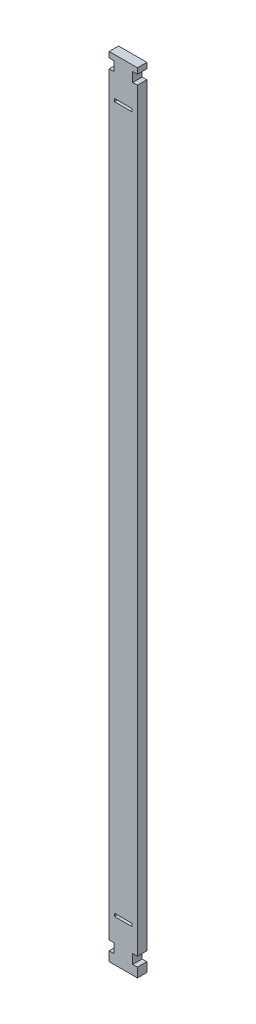
ISO-10303-21;
HEADER;
FILE_DESCRIPTION(('STEP AP214'),'2;1');
FILE_NAME('part.step','',(''),(''),'','','');
FILE_SCHEMA(('AUTOMOTIVE_DESIGN { 1 0 10303 214 1 1 1 1 }'));
ENDSEC;
DATA;
#1=APPLICATION_CONTEXT('core data for automotive mechanical design processes');
#2=APPLICATION_PROTOCOL_DEFINITION('international standard','automotive_design',2000,#1);
#3=PRODUCT_CONTEXT('',#1,'mechanical');
#4=PRODUCT('Part','Part','',(#3));
#5=PRODUCT_RELATED_PRODUCT_CATEGORY('part','',(#4));
#6=PRODUCT_DEFINITION_FORMATION('','',#4);
#7=PRODUCT_DEFINITION_CONTEXT('part definition',#1,'design');
#8=PRODUCT_DEFINITION('design','',#6,#7);
#9=PRODUCT_DEFINITION_SHAPE('','',#8);
#10=(LENGTH_UNIT() NAMED_UNIT(*) SI_UNIT(.MILLI.,.METRE.));
#11=(NAMED_UNIT(*) PLANE_ANGLE_UNIT() SI_UNIT($,.RADIAN.));
#12=(NAMED_UNIT(*) SI_UNIT($,.STERADIAN.) SOLID_ANGLE_UNIT());
#13=UNCERTAINTY_MEASURE_WITH_UNIT(LENGTH_MEASURE(1.E-05),#10,'distance_accuracy_value','');
#14=(GEOMETRIC_REPRESENTATION_CONTEXT(3) GLOBAL_UNCERTAINTY_ASSIGNED_CONTEXT((#13)) GLOBAL_UNIT_ASSIGNED_CONTEXT((#10,
#11,#12)) REPRESENTATION_CONTEXT('',''));
#15=CARTESIAN_POINT('',(0.,0.,0.));
#16=DIRECTION('',(0.,0.,1.));
#17=DIRECTION('',(1.,0.,0.));
#18=AXIS2_PLACEMENT_3D('',#15,#16,#17);
#19=CARTESIAN_POINT('',(7.49999999999998,-225.,5.));
#20=DIRECTION('',(-1.,0.,0.));
#21=DIRECTION('',(0.,0.,1.));
#22=AXIS2_PLACEMENT_3D('',#19,#20,#21);
#23=PLANE('',#22);
#24=DIRECTION('',(0.,1.,0.));
#25=VECTOR('',#24,1.);
#26=CARTESIAN_POINT('',(7.49999999999998,-225.,0.));
#27=LINE('',#26,#25);
#28=CARTESIAN_POINT('',(7.49999999999998,-225.,0.));
#29=VERTEX_POINT('',#28);
#30=CARTESIAN_POINT('',(7.49999999999998,-220.,0.));
#31=VERTEX_POINT('',#30);
#32=EDGE_CURVE('E414',#29,#31,#27,.T.);
#33=ORIENTED_EDGE('',*,*,#32,.T.);
#34=DIRECTION('',(0.,0.,1.));
#35=VECTOR('',#34,1.);
#36=CARTESIAN_POINT('',(7.49999999999998,-220.,-0.00100000000000013));
#37=LINE('',#36,#35);
#38=CARTESIAN_POINT('',(7.49999999999998,-220.,5.));
#39=VERTEX_POINT('',#38);
#40=EDGE_CURVE('E341',#31,#39,#37,.T.);
#41=ORIENTED_EDGE('',*,*,#40,.T.);
#42=DIRECTION('',(0.,1.,0.));
#43=VECTOR('',#42,1.);
#44=CARTESIAN_POINT('',(7.49999999999998,-225.,5.));
#45=LINE('',#44,#43);
#46=CARTESIAN_POINT('',(7.49999999999998,-225.,5.));
#47=VERTEX_POINT('',#46);
#48=EDGE_CURVE('E403',#47,#39,#45,.T.);
#49=ORIENTED_EDGE('',*,*,#48,.F.);
#50=DIRECTION('',(0.,0.,-1.));
#51=VECTOR('',#50,1.);
#52=CARTESIAN_POINT('',(7.49999999999998,-225.,5.));
#53=LINE('',#52,#51);
#54=EDGE_CURVE('E42',#47,#29,#53,.T.);
#55=ORIENTED_EDGE('',*,*,#54,.T.);
#56=EDGE_LOOP('',(#33,#41,#49,#55));
#57=FACE_BOUND('',#56,.T.);
#58=ADVANCED_FACE('F34',(#57),#23,.F.);
#59=CARTESIAN_POINT('',(7.49999999999998,-215.,5.));
#60=VERTEX_POINT('',#59);
#61=CARTESIAN_POINT('',(7.49999999999998,185.,5.));
#62=VERTEX_POINT('',#61);
#63=EDGE_CURVE('E407',#60,#62,#45,.T.);
#64=ORIENTED_EDGE('',*,*,#63,.F.);
#65=DIRECTION('',(0.,0.,1.));
#66=VECTOR('',#65,1.);
#67=CARTESIAN_POINT('',(7.49999999999998,-215.,-0.00100000000000013));
#68=LINE('',#67,#66);
#69=CARTESIAN_POINT('',(7.49999999999998,-215.,0.));
#70=VERTEX_POINT('',#69);
#71=EDGE_CURVE('E340',#70,#60,#68,.T.);
#72=ORIENTED_EDGE('',*,*,#71,.F.);
#73=CARTESIAN_POINT('',(7.49999999999998,185.,0.));
#74=VERTEX_POINT('',#73);
#75=EDGE_CURVE('E418',#70,#74,#27,.T.);
#76=ORIENTED_EDGE('',*,*,#75,.T.);
#77=DIRECTION('',(0.,0.,1.));
#78=VECTOR('',#77,1.);
#79=CARTESIAN_POINT('',(7.49999999999998,185.,-0.00100000000000013));
#80=LINE('',#79,#78);
#81=EDGE_CURVE('E305',#74,#62,#80,.T.);
#82=ORIENTED_EDGE('',*,*,#81,.T.);
#83=EDGE_LOOP('',(#64,#72,#76,#82));
#84=FACE_BOUND('',#83,.T.);
#85=ADVANCED_FACE('F500',(#84),#23,.F.);
#86=CARTESIAN_POINT('',(-7.50000000000001,-225.,5.));
#87=DIRECTION('',(1.,0.,0.));
#88=DIRECTION('',(0.,0.,-1.));
#89=AXIS2_PLACEMENT_3D('',#86,#87,#88);
#90=PLANE('',#89);
#91=DIRECTION('',(0.,-1.,0.));
#92=VECTOR('',#91,1.);
#93=CARTESIAN_POINT('',(-7.50000000000001,-225.,0.));
#94=LINE('',#93,#92);
#95=CARTESIAN_POINT('',(-7.50000000000001,193.,0.));
#96=VERTEX_POINT('',#95);
#97=CARTESIAN_POINT('',(-7.50000000000001,190.,0.));
#98=VERTEX_POINT('',#97);
#99=EDGE_CURVE('E421',#96,#98,#94,.T.);
#100=ORIENTED_EDGE('',*,*,#99,.T.);
#101=DIRECTION('',(0.,0.,1.));
#102=VECTOR('',#101,1.);
#103=CARTESIAN_POINT('',(-7.50000000000001,190.,-0.00100000000000013));
#104=LINE('',#103,#102);
#105=CARTESIAN_POINT('',(-7.50000000000001,190.,5.));
#106=VERTEX_POINT('',#105);
#107=EDGE_CURVE('E367',#98,#106,#104,.T.);
#108=ORIENTED_EDGE('',*,*,#107,.T.);
#109=DIRECTION('',(0.,-1.,0.));
#110=VECTOR('',#109,1.);
#111=CARTESIAN_POINT('',(-7.50000000000001,-225.,5.));
#112=LINE('',#111,#110);
#113=CARTESIAN_POINT('',(-7.5,193.,5.));
#114=VERTEX_POINT('',#113);
#115=EDGE_CURVE('E411',#114,#106,#112,.T.);
#116=ORIENTED_EDGE('',*,*,#115,.F.);
#117=DIRECTION('',(0.,0.,1.));
#118=VECTOR('',#117,1.);
#119=CARTESIAN_POINT('',(-7.5,193.,-0.00100000000000013));
#120=LINE('',#119,#118);
#121=EDGE_CURVE('E318',#96,#114,#120,.T.);
#122=ORIENTED_EDGE('',*,*,#121,.F.);
#123=EDGE_LOOP('',(#100,#108,#116,#122));
#124=FACE_BOUND('',#123,.T.);
#125=ADVANCED_FACE('F472',(#124),#90,.F.);
#126=CARTESIAN_POINT('',(-7.50000000000001,185.,5.));
#127=VERTEX_POINT('',#126);
#128=CARTESIAN_POINT('',(-7.50000000000001,-215.,5.));
#129=VERTEX_POINT('',#128);
#130=EDGE_CURVE('E410',#127,#129,#112,.T.);
#131=ORIENTED_EDGE('',*,*,#130,.F.);
#132=DIRECTION('',(0.,0.,1.));
#133=VECTOR('',#132,1.);
#134=CARTESIAN_POINT('',(-7.50000000000001,185.,-0.00100000000000013));
#135=LINE('',#134,#133);
#136=CARTESIAN_POINT('',(-7.50000000000001,185.,0.));
#137=VERTEX_POINT('',#136);
#138=EDGE_CURVE('E366',#137,#127,#135,.T.);
#139=ORIENTED_EDGE('',*,*,#138,.F.);
#140=CARTESIAN_POINT('',(-7.50000000000001,-215.,0.));
#141=VERTEX_POINT('',#140);
#142=EDGE_CURVE('E420',#137,#141,#94,.T.);
#143=ORIENTED_EDGE('',*,*,#142,.T.);
#144=DIRECTION('',(0.,0.,1.));
#145=VECTOR('',#144,1.);
#146=CARTESIAN_POINT('',(-7.50000000000001,-215.,-0.00100000000000013));
#147=LINE('',#146,#145);
#148=EDGE_CURVE('E391',#141,#129,#147,.T.);
#149=ORIENTED_EDGE('',*,*,#148,.T.);
#150=EDGE_LOOP('',(#131,#139,#143,#149));
#151=FACE_BOUND('',#150,.T.);
#152=ADVANCED_FACE('F466',(#151),#90,.F.);
#153=CARTESIAN_POINT('',(7.49999999999998,190.,5.));
#154=VERTEX_POINT('',#153);
#155=CARTESIAN_POINT('',(7.49999999999998,193.,5.));
#156=VERTEX_POINT('',#155);
#157=EDGE_CURVE('E408',#154,#156,#45,.T.);
#158=ORIENTED_EDGE('',*,*,#157,.F.);
#159=DIRECTION('',(0.,0.,1.));
#160=VECTOR('',#159,1.);
#161=CARTESIAN_POINT('',(7.49999999999998,190.,-0.00100000000000013));
#162=LINE('',#161,#160);
#163=CARTESIAN_POINT('',(7.49999999999998,190.,0.));
#164=VERTEX_POINT('',#163);
#165=EDGE_CURVE('E304',#164,#154,#162,.T.);
#166=ORIENTED_EDGE('',*,*,#165,.F.);
#167=CARTESIAN_POINT('',(7.49999999999998,193.,0.));
#168=VERTEX_POINT('',#167);
#169=EDGE_CURVE('E402',#164,#168,#27,.T.);
#170=ORIENTED_EDGE('',*,*,#169,.T.);
#171=DIRECTION('',(0.,0.,1.));
#172=VECTOR('',#171,1.);
#173=CARTESIAN_POINT('',(7.49999999999998,193.,-0.00100000000000013));
#174=LINE('',#173,#172);
#175=EDGE_CURVE('E319',#168,#156,#174,.T.);
#176=ORIENTED_EDGE('',*,*,#175,.T.);
#177=EDGE_LOOP('',(#158,#166,#170,#176));
#178=FACE_BOUND('',#177,.T.);
#179=ADVANCED_FACE('F36',(#178),#23,.F.);
#180=CARTESIAN_POINT('',(-7.50000000000001,-220.,5.));
#181=VERTEX_POINT('',#180);
#182=CARTESIAN_POINT('',(-7.50000000000001,-225.,5.));
#183=VERTEX_POINT('',#182);
#184=EDGE_CURVE('E406',#181,#183,#112,.T.);
#185=ORIENTED_EDGE('',*,*,#184,.F.);
#186=DIRECTION('',(0.,0.,1.));
#187=VECTOR('',#186,1.);
#188=CARTESIAN_POINT('',(-7.50000000000001,-220.,-0.00100000000000013));
#189=LINE('',#188,#187);
#190=CARTESIAN_POINT('',(-7.50000000000001,-220.,0.));
#191=VERTEX_POINT('',#190);
#192=EDGE_CURVE('E390',#191,#181,#189,.T.);
#193=ORIENTED_EDGE('',*,*,#192,.F.);
#194=CARTESIAN_POINT('',(-7.50000000000001,-225.,0.));
#195=VERTEX_POINT('',#194);
#196=EDGE_CURVE('E417',#191,#195,#94,.T.);
#197=ORIENTED_EDGE('',*,*,#196,.T.);
#198=DIRECTION('',(0.,0.,-1.));
#199=VECTOR('',#198,1.);
#200=CARTESIAN_POINT('',(-7.50000000000001,-225.,5.));
#201=LINE('',#200,#199);
#202=EDGE_CURVE('E11',#183,#195,#201,.T.);
#203=ORIENTED_EDGE('',*,*,#202,.F.);
#204=EDGE_LOOP('',(#185,#193,#197,#203));
#205=FACE_BOUND('',#204,.T.);
#206=ADVANCED_FACE('F449',(#205),#90,.F.);
#207=CARTESIAN_POINT('',(-7.50000000000001,-225.,5.));
#208=DIRECTION('',(0.,1.,0.));
#209=DIRECTION('',(0.,0.,1.));
#210=AXIS2_PLACEMENT_3D('',#207,#208,#209);
#211=PLANE('',#210);
#212=DIRECTION('',(1.,0.,0.));
#213=VECTOR('',#212,1.);
#214=CARTESIAN_POINT('',(-7.50000000000001,-225.,0.));
#215=LINE('',#214,#213);
#216=EDGE_CURVE('E422',#195,#29,#215,.T.);
#217=ORIENTED_EDGE('',*,*,#216,.T.);
#218=ORIENTED_EDGE('',*,*,#54,.F.);
#219=DIRECTION('',(1.,0.,0.));
#220=VECTOR('',#219,1.);
#221=CARTESIAN_POINT('',(-7.50000000000001,-225.,5.));
#222=LINE('',#221,#220);
#223=EDGE_CURVE('E412',#183,#47,#222,.T.);
#224=ORIENTED_EDGE('',*,*,#223,.F.);
#225=ORIENTED_EDGE('',*,*,#202,.T.);
#226=EDGE_LOOP('',(#217,#218,#224,#225));
#227=FACE_BOUND('',#226,.T.);
#228=ADVANCED_FACE('F447',(#227),#211,.F.);
#229=CARTESIAN_POINT('',(0.,0.,5.));
#230=DIRECTION('',(0.,0.,-1.));
#231=DIRECTION('',(-1.,0.,0.));
#232=AXIS2_PLACEMENT_3D('',#229,#230,#231);
#233=PLANE('',#232);
#234=DIRECTION('',(-1.,0.,0.));
#235=VECTOR('',#234,1.);
#236=CARTESIAN_POINT('',(-4.74999999999991,-201.335,5.));
#237=LINE('',#236,#235);
#238=CARTESIAN_POINT('',(4.75000000000009,-201.335,5.));
#239=VERTEX_POINT('',#238);
#240=CARTESIAN_POINT('',(-4.74999999999991,-201.335,5.));
#241=VERTEX_POINT('',#240);
#242=EDGE_CURVE('E243',#239,#241,#237,.T.);
#243=ORIENTED_EDGE('',*,*,#242,.F.);
#244=DIRECTION('',(0.,1.,0.));
#245=VECTOR('',#244,1.);
#246=CARTESIAN_POINT('',(4.75000000000009,-201.335,5.));
#247=LINE('',#246,#245);
#248=CARTESIAN_POINT('',(4.75000000000009,-202.835,5.));
#249=VERTEX_POINT('',#248);
#250=EDGE_CURVE('E49',#249,#239,#247,.T.);
#251=ORIENTED_EDGE('',*,*,#250,.F.);
#252=DIRECTION('',(1.,0.,0.));
#253=VECTOR('',#252,1.);
#254=CARTESIAN_POINT('',(-4.74999999999991,-202.835,5.));
#255=LINE('',#254,#253);
#256=CARTESIAN_POINT('',(-4.74999999999991,-202.835,5.));
#257=VERTEX_POINT('',#256);
#258=EDGE_CURVE('E236',#257,#249,#255,.T.);
#259=ORIENTED_EDGE('',*,*,#258,.F.);
#260=DIRECTION('',(0.,-1.,0.));
#261=VECTOR('',#260,1.);
#262=CARTESIAN_POINT('',(-4.74999999999991,-201.335,5.));
#263=LINE('',#262,#261);
#264=EDGE_CURVE('E250',#241,#257,#263,.T.);
#265=ORIENTED_EDGE('',*,*,#264,.F.);
#266=EDGE_LOOP('',(#243,#251,#259,#265));
#267=FACE_BOUND('',#266,.T.);
#268=DIRECTION('',(-1.,0.,0.));
#269=VECTOR('',#268,1.);
#270=CARTESIAN_POINT('',(-4.75,172.835,5.));
#271=LINE('',#270,#269);
#272=CARTESIAN_POINT('',(4.75,172.835,5.));
#273=VERTEX_POINT('',#272);
#274=CARTESIAN_POINT('',(-4.75,172.835,5.));
#275=VERTEX_POINT('',#274);
#276=EDGE_CURVE('E269',#273,#275,#271,.T.);
#277=ORIENTED_EDGE('',*,*,#276,.F.);
#278=DIRECTION('',(0.,1.,0.));
#279=VECTOR('',#278,1.);
#280=CARTESIAN_POINT('',(4.75,171.335,5.));
#281=LINE('',#280,#279);
#282=CARTESIAN_POINT('',(4.75,171.335,5.));
#283=VERTEX_POINT('',#282);
#284=EDGE_CURVE('E57',#283,#273,#281,.T.);
#285=ORIENTED_EDGE('',*,*,#284,.F.);
#286=DIRECTION('',(1.,0.,0.));
#287=VECTOR('',#286,1.);
#288=CARTESIAN_POINT('',(-4.75,171.335,5.));
#289=LINE('',#288,#287);
#290=CARTESIAN_POINT('',(-4.75,171.335,5.));
#291=VERTEX_POINT('',#290);
#292=EDGE_CURVE('E275',#291,#283,#289,.T.);
#293=ORIENTED_EDGE('',*,*,#292,.F.);
#294=DIRECTION('',(0.,-1.,0.));
#295=VECTOR('',#294,1.);
#296=CARTESIAN_POINT('',(-4.75,171.335,5.));
#297=LINE('',#296,#295);
#298=EDGE_CURVE('E272',#275,#291,#297,.T.);
#299=ORIENTED_EDGE('',*,*,#298,.F.);
#300=EDGE_LOOP('',(#277,#285,#293,#299));
#301=FACE_BOUND('',#300,.T.);
#302=ORIENTED_EDGE('',*,*,#48,.T.);
#303=DIRECTION('',(1.,0.,0.));
#304=VECTOR('',#303,1.);
#305=CARTESIAN_POINT('',(7.49999999999998,-220.,5.));
#306=LINE('',#305,#304);
#307=CARTESIAN_POINT('',(4.99999999999998,-220.,5.));
#308=VERTEX_POINT('',#307);
#309=EDGE_CURVE('E338',#308,#39,#306,.T.);
#310=ORIENTED_EDGE('',*,*,#309,.F.);
#311=DIRECTION('',(0.,-1.,0.));
#312=VECTOR('',#311,1.);
#313=CARTESIAN_POINT('',(4.99999999999998,-215.,5.));
#314=LINE('',#313,#312);
#315=CARTESIAN_POINT('',(4.99999999999998,-215.,5.));
#316=VERTEX_POINT('',#315);
#317=EDGE_CURVE('E335',#316,#308,#314,.T.);
#318=ORIENTED_EDGE('',*,*,#317,.F.);
#319=DIRECTION('',(-1.,0.,0.));
#320=VECTOR('',#319,1.);
#321=CARTESIAN_POINT('',(7.49999999999998,-215.,5.));
#322=LINE('',#321,#320);
#323=EDGE_CURVE('E332',#60,#316,#322,.T.);
#324=ORIENTED_EDGE('',*,*,#323,.F.);
#325=ORIENTED_EDGE('',*,*,#63,.T.);
#326=DIRECTION('',(1.,0.,0.));
#327=VECTOR('',#326,1.);
#328=CARTESIAN_POINT('',(7.49999999999998,185.,5.));
#329=LINE('',#328,#327);
#330=CARTESIAN_POINT('',(4.99999999999996,185.,5.));
#331=VERTEX_POINT('',#330);
#332=EDGE_CURVE('E302',#331,#62,#329,.T.);
#333=ORIENTED_EDGE('',*,*,#332,.F.);
#334=DIRECTION('',(0.,-1.,0.));
#335=VECTOR('',#334,1.);
#336=CARTESIAN_POINT('',(4.99999999999996,190.,5.));
#337=LINE('',#336,#335);
#338=CARTESIAN_POINT('',(4.99999999999996,190.,5.));
#339=VERTEX_POINT('',#338);
#340=EDGE_CURVE('E299',#339,#331,#337,.T.);
#341=ORIENTED_EDGE('',*,*,#340,.F.);
#342=DIRECTION('',(-1.,0.,0.));
#343=VECTOR('',#342,1.);
#344=CARTESIAN_POINT('',(7.49999999999998,190.,5.));
#345=LINE('',#344,#343);
#346=EDGE_CURVE('E296',#154,#339,#345,.T.);
#347=ORIENTED_EDGE('',*,*,#346,.F.);
#348=ORIENTED_EDGE('',*,*,#157,.T.);
#349=DIRECTION('',(1.,0.,0.));
#350=VECTOR('',#349,1.);
#351=CARTESIAN_POINT('',(-7.5,193.,5.));
#352=LINE('',#351,#350);
#353=EDGE_CURVE('E230',#114,#156,#352,.T.);
#354=ORIENTED_EDGE('',*,*,#353,.F.);
#355=ORIENTED_EDGE('',*,*,#115,.T.);
#356=DIRECTION('',(-1.,0.,0.));
#357=VECTOR('',#356,1.);
#358=CARTESIAN_POINT('',(-7.50000000000001,190.,5.));
#359=LINE('',#358,#357);
#360=CARTESIAN_POINT('',(-5.00000000000001,190.,5.));
#361=VERTEX_POINT('',#360);
#362=EDGE_CURVE('E364',#361,#106,#359,.T.);
#363=ORIENTED_EDGE('',*,*,#362,.F.);
#364=DIRECTION('',(0.,1.,0.));
#365=VECTOR('',#364,1.);
#366=CARTESIAN_POINT('',(-5.00000000000001,190.,5.));
#367=LINE('',#366,#365);
#368=CARTESIAN_POINT('',(-5.00000000000001,185.,5.));
#369=VERTEX_POINT('',#368);
#370=EDGE_CURVE('E361',#369,#361,#367,.T.);
#371=ORIENTED_EDGE('',*,*,#370,.F.);
#372=DIRECTION('',(1.,0.,0.));
#373=VECTOR('',#372,1.);
#374=CARTESIAN_POINT('',(-7.50000000000001,185.,5.));
#375=LINE('',#374,#373);
#376=EDGE_CURVE('E358',#127,#369,#375,.T.);
#377=ORIENTED_EDGE('',*,*,#376,.F.);
#378=ORIENTED_EDGE('',*,*,#130,.T.);
#379=DIRECTION('',(-1.,0.,0.));
#380=VECTOR('',#379,1.);
#381=CARTESIAN_POINT('',(-7.50000000000001,-215.,5.));
#382=LINE('',#381,#380);
#383=CARTESIAN_POINT('',(-5.00000000000001,-215.,5.));
#384=VERTEX_POINT('',#383);
#385=EDGE_CURVE('E388',#384,#129,#382,.T.);
#386=ORIENTED_EDGE('',*,*,#385,.F.);
#387=DIRECTION('',(0.,1.,0.));
#388=VECTOR('',#387,1.);
#389=CARTESIAN_POINT('',(-5.00000000000001,-215.,5.));
#390=LINE('',#389,#388);
#391=CARTESIAN_POINT('',(-5.00000000000001,-220.,5.));
#392=VERTEX_POINT('',#391);
#393=EDGE_CURVE('E385',#392,#384,#390,.T.);
#394=ORIENTED_EDGE('',*,*,#393,.F.);
#395=DIRECTION('',(1.,0.,0.));
#396=VECTOR('',#395,1.);
#397=CARTESIAN_POINT('',(-7.50000000000001,-220.,5.));
#398=LINE('',#397,#396);
#399=EDGE_CURVE('E382',#181,#392,#398,.T.);
#400=ORIENTED_EDGE('',*,*,#399,.F.);
#401=ORIENTED_EDGE('',*,*,#184,.T.);
#402=ORIENTED_EDGE('',*,*,#223,.T.);
#403=EDGE_LOOP('',(#302,#310,#318,#324,#325,#333,#341,#347,#348,#354,#355,#363,#371,#377,#378,
#386,#394,#400,#401,#402));
#404=FACE_BOUND('',#403,.T.);
#405=ADVANCED_FACE('F443',(#267,#301,#404),#233,.F.);
#406=CARTESIAN_POINT('',(0.,0.,0.));
#407=DIRECTION('',(0.,0.,-1.));
#408=DIRECTION('',(-1.,0.,0.));
#409=AXIS2_PLACEMENT_3D('',#406,#407,#408);
#410=PLANE('',#409);
#411=DIRECTION('',(0.,1.,0.));
#412=VECTOR('',#411,1.);
#413=CARTESIAN_POINT('',(4.75000000000009,-201.335,0.));
#414=LINE('',#413,#412);
#415=CARTESIAN_POINT('',(4.75000000000009,-202.835,0.));
#416=VERTEX_POINT('',#415);
#417=CARTESIAN_POINT('',(4.75000000000009,-201.335,0.));
#418=VERTEX_POINT('',#417);
#419=EDGE_CURVE('E234',#416,#418,#414,.T.);
#420=ORIENTED_EDGE('',*,*,#419,.T.);
#421=DIRECTION('',(-1.,0.,0.));
#422=VECTOR('',#421,1.);
#423=CARTESIAN_POINT('',(-4.74999999999991,-201.335,0.));
#424=LINE('',#423,#422);
#425=CARTESIAN_POINT('',(-4.74999999999991,-201.335,0.));
#426=VERTEX_POINT('',#425);
#427=EDGE_CURVE('E220',#418,#426,#424,.T.);
#428=ORIENTED_EDGE('',*,*,#427,.T.);
#429=DIRECTION('',(0.,-1.,0.));
#430=VECTOR('',#429,1.);
#431=CARTESIAN_POINT('',(-4.74999999999991,-201.335,0.));
#432=LINE('',#431,#430);
#433=CARTESIAN_POINT('',(-4.74999999999991,-202.835,0.));
#434=VERTEX_POINT('',#433);
#435=EDGE_CURVE('E245',#426,#434,#432,.T.);
#436=ORIENTED_EDGE('',*,*,#435,.T.);
#437=DIRECTION('',(1.,0.,0.));
#438=VECTOR('',#437,1.);
#439=CARTESIAN_POINT('',(-4.74999999999991,-202.835,0.));
#440=LINE('',#439,#438);
#441=EDGE_CURVE('E241',#434,#416,#440,.T.);
#442=ORIENTED_EDGE('',*,*,#441,.T.);
#443=EDGE_LOOP('',(#420,#428,#436,#442));
#444=FACE_BOUND('',#443,.T.);
#445=DIRECTION('',(0.,1.,0.));
#446=VECTOR('',#445,1.);
#447=CARTESIAN_POINT('',(4.75,171.335,0.));
#448=LINE('',#447,#446);
#449=CARTESIAN_POINT('',(4.75,171.335,0.));
#450=VERTEX_POINT('',#449);
#451=CARTESIAN_POINT('',(4.75,172.835,0.));
#452=VERTEX_POINT('',#451);
#453=EDGE_CURVE('E265',#450,#452,#448,.T.);
#454=ORIENTED_EDGE('',*,*,#453,.T.);
#455=DIRECTION('',(-1.,0.,0.));
#456=VECTOR('',#455,1.);
#457=CARTESIAN_POINT('',(-4.75,172.835,0.));
#458=LINE('',#457,#456);
#459=CARTESIAN_POINT('',(-4.75,172.835,0.));
#460=VERTEX_POINT('',#459);
#461=EDGE_CURVE('E281',#452,#460,#458,.T.);
#462=ORIENTED_EDGE('',*,*,#461,.T.);
#463=DIRECTION('',(0.,-1.,0.));
#464=VECTOR('',#463,1.);
#465=CARTESIAN_POINT('',(-4.75,171.335,0.));
#466=LINE('',#465,#464);
#467=CARTESIAN_POINT('',(-4.75,171.335,0.));
#468=VERTEX_POINT('',#467);
#469=EDGE_CURVE('E259',#460,#468,#466,.T.);
#470=ORIENTED_EDGE('',*,*,#469,.T.);
#471=DIRECTION('',(1.,0.,0.));
#472=VECTOR('',#471,1.);
#473=CARTESIAN_POINT('',(-4.75,171.335,0.));
#474=LINE('',#473,#472);
#475=EDGE_CURVE('E262',#468,#450,#474,.T.);
#476=ORIENTED_EDGE('',*,*,#475,.T.);
#477=EDGE_LOOP('',(#454,#462,#470,#476));
#478=FACE_BOUND('',#477,.T.);
#479=DIRECTION('',(1.,0.,0.));
#480=VECTOR('',#479,1.);
#481=CARTESIAN_POINT('',(7.49999999999998,-220.,0.));
#482=LINE('',#481,#480);
#483=CARTESIAN_POINT('',(4.99999999999998,-220.,0.));
#484=VERTEX_POINT('',#483);
#485=EDGE_CURVE('E328',#484,#31,#482,.T.);
#486=ORIENTED_EDGE('',*,*,#485,.T.);
#487=ORIENTED_EDGE('',*,*,#32,.F.);
#488=ORIENTED_EDGE('',*,*,#216,.F.);
#489=ORIENTED_EDGE('',*,*,#196,.F.);
#490=DIRECTION('',(1.,0.,0.));
#491=VECTOR('',#490,1.);
#492=CARTESIAN_POINT('',(-7.50000000000001,-220.,0.));
#493=LINE('',#492,#491);
#494=CARTESIAN_POINT('',(-5.00000000000001,-220.,0.));
#495=VERTEX_POINT('',#494);
#496=EDGE_CURVE('E394',#191,#495,#493,.T.);
#497=ORIENTED_EDGE('',*,*,#496,.T.);
#498=DIRECTION('',(0.,1.,0.));
#499=VECTOR('',#498,1.);
#500=CARTESIAN_POINT('',(-5.00000000000001,-215.,0.));
#501=LINE('',#500,#499);
#502=CARTESIAN_POINT('',(-5.00000000000001,-215.,0.));
#503=VERTEX_POINT('',#502);
#504=EDGE_CURVE('E352',#495,#503,#501,.T.);
#505=ORIENTED_EDGE('',*,*,#504,.T.);
#506=DIRECTION('',(-1.,0.,0.));
#507=VECTOR('',#506,1.);
#508=CARTESIAN_POINT('',(-7.50000000000001,-215.,0.));
#509=LINE('',#508,#507);
#510=EDGE_CURVE('E379',#503,#141,#509,.T.);
#511=ORIENTED_EDGE('',*,*,#510,.T.);
#512=ORIENTED_EDGE('',*,*,#142,.F.);
#513=DIRECTION('',(1.,0.,0.));
#514=VECTOR('',#513,1.);
#515=CARTESIAN_POINT('',(-7.50000000000001,185.,0.));
#516=LINE('',#515,#514);
#517=CARTESIAN_POINT('',(-5.00000000000001,185.,0.));
#518=VERTEX_POINT('',#517);
#519=EDGE_CURVE('E329',#137,#518,#516,.T.);
#520=ORIENTED_EDGE('',*,*,#519,.T.);
#521=DIRECTION('',(0.,1.,0.));
#522=VECTOR('',#521,1.);
#523=CARTESIAN_POINT('',(-5.00000000000001,190.,0.));
#524=LINE('',#523,#522);
#525=CARTESIAN_POINT('',(-5.00000000000001,190.,0.));
#526=VERTEX_POINT('',#525);
#527=EDGE_CURVE('E316',#518,#526,#524,.T.);
#528=ORIENTED_EDGE('',*,*,#527,.T.);
#529=DIRECTION('',(-1.,0.,0.));
#530=VECTOR('',#529,1.);
#531=CARTESIAN_POINT('',(-7.50000000000001,190.,0.));
#532=LINE('',#531,#530);
#533=EDGE_CURVE('E355',#526,#98,#532,.T.);
#534=ORIENTED_EDGE('',*,*,#533,.T.);
#535=ORIENTED_EDGE('',*,*,#99,.F.);
#536=DIRECTION('',(1.,0.,0.));
#537=VECTOR('',#536,1.);
#538=CARTESIAN_POINT('',(-7.5,193.,0.));
#539=LINE('',#538,#537);
#540=EDGE_CURVE('E293',#96,#168,#539,.T.);
#541=ORIENTED_EDGE('',*,*,#540,.T.);
#542=ORIENTED_EDGE('',*,*,#169,.F.);
#543=DIRECTION('',(-1.,0.,0.));
#544=VECTOR('',#543,1.);
#545=CARTESIAN_POINT('',(7.49999999999998,190.,0.));
#546=LINE('',#545,#544);
#547=CARTESIAN_POINT('',(4.99999999999996,190.,0.));
#548=VERTEX_POINT('',#547);
#549=EDGE_CURVE('E308',#164,#548,#546,.T.);
#550=ORIENTED_EDGE('',*,*,#549,.T.);
#551=DIRECTION('',(0.,-1.,0.));
#552=VECTOR('',#551,1.);
#553=CARTESIAN_POINT('',(4.99999999999996,190.,0.));
#554=LINE('',#553,#552);
#555=CARTESIAN_POINT('',(4.99999999999996,185.,0.));
#556=VERTEX_POINT('',#555);
#557=EDGE_CURVE('E289',#548,#556,#554,.T.);
#558=ORIENTED_EDGE('',*,*,#557,.T.);
#559=DIRECTION('',(1.,0.,0.));
#560=VECTOR('',#559,1.);
#561=CARTESIAN_POINT('',(7.49999999999998,185.,0.));
#562=LINE('',#561,#560);
#563=EDGE_CURVE('E292',#556,#74,#562,.T.);
#564=ORIENTED_EDGE('',*,*,#563,.T.);
#565=ORIENTED_EDGE('',*,*,#75,.F.);
#566=DIRECTION('',(-1.,0.,0.));
#567=VECTOR('',#566,1.);
#568=CARTESIAN_POINT('',(7.49999999999998,-215.,0.));
#569=LINE('',#568,#567);
#570=CARTESIAN_POINT('',(4.99999999999998,-215.,0.));
#571=VERTEX_POINT('',#570);
#572=EDGE_CURVE('E344',#70,#571,#569,.T.);
#573=ORIENTED_EDGE('',*,*,#572,.T.);
#574=DIRECTION('',(0.,-1.,0.));
#575=VECTOR('',#574,1.);
#576=CARTESIAN_POINT('',(4.99999999999998,-215.,0.));
#577=LINE('',#576,#575);
#578=EDGE_CURVE('E325',#571,#484,#577,.T.);
#579=ORIENTED_EDGE('',*,*,#578,.T.);
#580=EDGE_LOOP('',(#486,#487,#488,#489,#497,#505,#511,#512,#520,#528,#534,#535,#541,#542,#550,
#558,#564,#565,#573,#579));
#581=FACE_BOUND('',#580,.T.);
#582=ADVANCED_FACE('F239',(#444,#478,#581),#410,.T.);
#583=CARTESIAN_POINT('',(-7.50000000000001,-215.,-0.00100000000000013));
#584=DIRECTION('',(0.,1.,0.));
#585=DIRECTION('',(0.,0.,1.));
#586=AXIS2_PLACEMENT_3D('',#583,#584,#585);
#587=PLANE('',#586);
#588=DIRECTION('',(0.,0.,1.));
#589=VECTOR('',#588,1.);
#590=CARTESIAN_POINT('',(-5.00000000000001,-215.,-0.00100000000000013));
#591=LINE('',#590,#589);
#592=EDGE_CURVE('E395',#503,#384,#591,.T.);
#593=ORIENTED_EDGE('',*,*,#592,.T.);
#594=ORIENTED_EDGE('',*,*,#385,.T.);
#595=ORIENTED_EDGE('',*,*,#148,.F.);
#596=ORIENTED_EDGE('',*,*,#510,.F.);
#597=EDGE_LOOP('',(#593,#594,#595,#596));
#598=FACE_BOUND('',#597,.T.);
#599=ADVANCED_FACE('F460',(#598),#587,.F.);
#600=CARTESIAN_POINT('',(-5.00000000000001,-215.,-0.00100000000000013));
#601=DIRECTION('',(1.,0.,0.));
#602=DIRECTION('',(0.,1.,0.));
#603=AXIS2_PLACEMENT_3D('',#600,#601,#602);
#604=PLANE('',#603);
#605=DIRECTION('',(0.,0.,1.));
#606=VECTOR('',#605,1.);
#607=CARTESIAN_POINT('',(-5.00000000000001,-220.,-0.00100000000000013));
#608=LINE('',#607,#606);
#609=EDGE_CURVE('E397',#495,#392,#608,.T.);
#610=ORIENTED_EDGE('',*,*,#609,.T.);
#611=ORIENTED_EDGE('',*,*,#393,.T.);
#612=ORIENTED_EDGE('',*,*,#592,.F.);
#613=ORIENTED_EDGE('',*,*,#504,.F.);
#614=EDGE_LOOP('',(#610,#611,#612,#613));
#615=FACE_BOUND('',#614,.T.);
#616=ADVANCED_FACE('F457',(#615),#604,.F.);
#617=CARTESIAN_POINT('',(-7.50000000000001,-220.,-0.00100000000000013));
#618=DIRECTION('',(0.,-1.,0.));
#619=DIRECTION('',(0.,0.,-1.));
#620=AXIS2_PLACEMENT_3D('',#617,#618,#619);
#621=PLANE('',#620);
#622=ORIENTED_EDGE('',*,*,#192,.T.);
#623=ORIENTED_EDGE('',*,*,#399,.T.);
#624=ORIENTED_EDGE('',*,*,#609,.F.);
#625=ORIENTED_EDGE('',*,*,#496,.F.);
#626=EDGE_LOOP('',(#622,#623,#624,#625));
#627=FACE_BOUND('',#626,.T.);
#628=ADVANCED_FACE('F453',(#627),#621,.F.);
#629=CARTESIAN_POINT('',(-7.5,193.,-0.00100000000000013));
#630=DIRECTION('',(0.,-1.,0.));
#631=DIRECTION('',(0.,0.,-1.));
#632=AXIS2_PLACEMENT_3D('',#629,#630,#631);
#633=PLANE('',#632);
#634=ORIENTED_EDGE('',*,*,#121,.T.);
#635=ORIENTED_EDGE('',*,*,#353,.T.);
#636=ORIENTED_EDGE('',*,*,#175,.F.);
#637=ORIENTED_EDGE('',*,*,#540,.F.);
#638=EDGE_LOOP('',(#634,#635,#636,#637));
#639=FACE_BOUND('',#638,.T.);
#640=ADVANCED_FACE('F540',(#639),#633,.F.);
#641=CARTESIAN_POINT('',(7.49999999999998,185.,-0.00100000000000013));
#642=DIRECTION('',(0.,-1.,0.));
#643=DIRECTION('',(0.,0.,-1.));
#644=AXIS2_PLACEMENT_3D('',#641,#642,#643);
#645=PLANE('',#644);
#646=DIRECTION('',(0.,0.,1.));
#647=VECTOR('',#646,1.);
#648=CARTESIAN_POINT('',(4.99999999999996,185.,-0.00100000000000013));
#649=LINE('',#648,#647);
#650=EDGE_CURVE('E309',#556,#331,#649,.T.);
#651=ORIENTED_EDGE('',*,*,#650,.T.);
#652=ORIENTED_EDGE('',*,*,#332,.T.);
#653=ORIENTED_EDGE('',*,*,#81,.F.);
#654=ORIENTED_EDGE('',*,*,#563,.F.);
#655=EDGE_LOOP('',(#651,#652,#653,#654));
#656=FACE_BOUND('',#655,.T.);
#657=ADVANCED_FACE('F523',(#656),#645,.F.);
#658=CARTESIAN_POINT('',(4.99999999999996,190.,-0.00100000000000013));
#659=DIRECTION('',(-1.,0.,0.));
#660=DIRECTION('',(0.,-1.,0.));
#661=AXIS2_PLACEMENT_3D('',#658,#659,#660);
#662=PLANE('',#661);
#663=DIRECTION('',(0.,0.,1.));
#664=VECTOR('',#663,1.);
#665=CARTESIAN_POINT('',(4.99999999999996,190.,-0.00100000000000013));
#666=LINE('',#665,#664);
#667=EDGE_CURVE('E311',#548,#339,#666,.T.);
#668=ORIENTED_EDGE('',*,*,#667,.T.);
#669=ORIENTED_EDGE('',*,*,#340,.T.);
#670=ORIENTED_EDGE('',*,*,#650,.F.);
#671=ORIENTED_EDGE('',*,*,#557,.F.);
#672=EDGE_LOOP('',(#668,#669,#670,#671));
#673=FACE_BOUND('',#672,.T.);
#674=ADVANCED_FACE('F527',(#673),#662,.F.);
#675=CARTESIAN_POINT('',(7.49999999999998,190.,-0.00100000000000013));
#676=DIRECTION('',(0.,1.,0.));
#677=DIRECTION('',(0.,0.,1.));
#678=AXIS2_PLACEMENT_3D('',#675,#676,#677);
#679=PLANE('',#678);
#680=ORIENTED_EDGE('',*,*,#165,.T.);
#681=ORIENTED_EDGE('',*,*,#346,.T.);
#682=ORIENTED_EDGE('',*,*,#667,.F.);
#683=ORIENTED_EDGE('',*,*,#549,.F.);
#684=EDGE_LOOP('',(#680,#681,#682,#683));
#685=FACE_BOUND('',#684,.T.);
#686=ADVANCED_FACE('F529',(#685),#679,.F.);
#687=CARTESIAN_POINT('',(-7.50000000000001,190.,-0.00100000000000013));
#688=DIRECTION('',(0.,1.,0.));
#689=DIRECTION('',(0.,0.,1.));
#690=AXIS2_PLACEMENT_3D('',#687,#688,#689);
#691=PLANE('',#690);
#692=DIRECTION('',(0.,0.,1.));
#693=VECTOR('',#692,1.);
#694=CARTESIAN_POINT('',(-5.00000000000001,190.,-0.00100000000000013));
#695=LINE('',#694,#693);
#696=EDGE_CURVE('E370',#526,#361,#695,.T.);
#697=ORIENTED_EDGE('',*,*,#696,.T.);
#698=ORIENTED_EDGE('',*,*,#362,.T.);
#699=ORIENTED_EDGE('',*,*,#107,.F.);
#700=ORIENTED_EDGE('',*,*,#533,.F.);
#701=EDGE_LOOP('',(#697,#698,#699,#700));
#702=FACE_BOUND('',#701,.T.);
#703=ADVANCED_FACE('F480',(#702),#691,.F.);
#704=CARTESIAN_POINT('',(-5.00000000000001,190.,-0.00100000000000013));
#705=DIRECTION('',(1.,0.,0.));
#706=DIRECTION('',(0.,1.,0.));
#707=AXIS2_PLACEMENT_3D('',#704,#705,#706);
#708=PLANE('',#707);
#709=DIRECTION('',(0.,0.,1.));
#710=VECTOR('',#709,1.);
#711=CARTESIAN_POINT('',(-5.00000000000001,185.,-0.00100000000000013));
#712=LINE('',#711,#710);
#713=EDGE_CURVE('E372',#518,#369,#712,.T.);
#714=ORIENTED_EDGE('',*,*,#713,.T.);
#715=ORIENTED_EDGE('',*,*,#370,.T.);
#716=ORIENTED_EDGE('',*,*,#696,.F.);
#717=ORIENTED_EDGE('',*,*,#527,.F.);
#718=EDGE_LOOP('',(#714,#715,#716,#717));
#719=FACE_BOUND('',#718,.T.);
#720=ADVANCED_FACE('F482',(#719),#708,.F.);
#721=CARTESIAN_POINT('',(-7.50000000000001,185.,-0.00100000000000013));
#722=DIRECTION('',(0.,-1.,0.));
#723=DIRECTION('',(0.,0.,-1.));
#724=AXIS2_PLACEMENT_3D('',#721,#722,#723);
#725=PLANE('',#724);
#726=ORIENTED_EDGE('',*,*,#138,.T.);
#727=ORIENTED_EDGE('',*,*,#376,.T.);
#728=ORIENTED_EDGE('',*,*,#713,.F.);
#729=ORIENTED_EDGE('',*,*,#519,.F.);
#730=EDGE_LOOP('',(#726,#727,#728,#729));
#731=FACE_BOUND('',#730,.T.);
#732=ADVANCED_FACE('F489',(#731),#725,.F.);
#733=CARTESIAN_POINT('',(7.49999999999998,-220.,-0.00100000000000013));
#734=DIRECTION('',(0.,-1.,0.));
#735=DIRECTION('',(0.,0.,-1.));
#736=AXIS2_PLACEMENT_3D('',#733,#734,#735);
#737=PLANE('',#736);
#738=DIRECTION('',(0.,0.,1.));
#739=VECTOR('',#738,1.);
#740=CARTESIAN_POINT('',(4.99999999999998,-220.,-0.00100000000000013));
#741=LINE('',#740,#739);
#742=EDGE_CURVE('E345',#484,#308,#741,.T.);
#743=ORIENTED_EDGE('',*,*,#742,.T.);
#744=ORIENTED_EDGE('',*,*,#309,.T.);
#745=ORIENTED_EDGE('',*,*,#40,.F.);
#746=ORIENTED_EDGE('',*,*,#485,.F.);
#747=EDGE_LOOP('',(#743,#744,#745,#746));
#748=FACE_BOUND('',#747,.T.);
#749=ADVANCED_FACE('F436',(#748),#737,.F.);
#750=CARTESIAN_POINT('',(4.99999999999998,-215.,-0.00100000000000013));
#751=DIRECTION('',(-1.,0.,0.));
#752=DIRECTION('',(0.,-1.,0.));
#753=AXIS2_PLACEMENT_3D('',#750,#751,#752);
#754=PLANE('',#753);
#755=DIRECTION('',(0.,0.,1.));
#756=VECTOR('',#755,1.);
#757=CARTESIAN_POINT('',(4.99999999999998,-215.,-0.00100000000000013));
#758=LINE('',#757,#756);
#759=EDGE_CURVE('E347',#571,#316,#758,.T.);
#760=ORIENTED_EDGE('',*,*,#759,.T.);
#761=ORIENTED_EDGE('',*,*,#317,.T.);
#762=ORIENTED_EDGE('',*,*,#742,.F.);
#763=ORIENTED_EDGE('',*,*,#578,.F.);
#764=EDGE_LOOP('',(#760,#761,#762,#763));
#765=FACE_BOUND('',#764,.T.);
#766=ADVANCED_FACE('F438',(#765),#754,.F.);
#767=CARTESIAN_POINT('',(7.49999999999998,-215.,-0.00100000000000013));
#768=DIRECTION('',(0.,1.,0.));
#769=DIRECTION('',(0.,0.,1.));
#770=AXIS2_PLACEMENT_3D('',#767,#768,#769);
#771=PLANE('',#770);
#772=ORIENTED_EDGE('',*,*,#71,.T.);
#773=ORIENTED_EDGE('',*,*,#323,.T.);
#774=ORIENTED_EDGE('',*,*,#759,.F.);
#775=ORIENTED_EDGE('',*,*,#572,.F.);
#776=EDGE_LOOP('',(#772,#773,#774,#775));
#777=FACE_BOUND('',#776,.T.);
#778=ADVANCED_FACE('F546',(#777),#771,.F.);
#779=CARTESIAN_POINT('',(4.75,171.335,-0.00100000000000013));
#780=DIRECTION('',(1.,0.,0.));
#781=DIRECTION('',(0.,0.,-1.));
#782=AXIS2_PLACEMENT_3D('',#779,#780,#781);
#783=PLANE('',#782);
#784=DIRECTION('',(0.,0.,1.));
#785=VECTOR('',#784,1.);
#786=CARTESIAN_POINT('',(4.75,171.335,-0.00100000000000013));
#787=LINE('',#786,#785);
#788=EDGE_CURVE('E279',#450,#283,#787,.T.);
#789=ORIENTED_EDGE('',*,*,#788,.T.);
#790=ORIENTED_EDGE('',*,*,#284,.T.);
#791=DIRECTION('',(0.,0.,1.));
#792=VECTOR('',#791,1.);
#793=CARTESIAN_POINT('',(4.75,172.835,-0.00100000000000013));
#794=LINE('',#793,#792);
#795=EDGE_CURVE('E278',#452,#273,#794,.T.);
#796=ORIENTED_EDGE('',*,*,#795,.F.);
#797=ORIENTED_EDGE('',*,*,#453,.F.);
#798=EDGE_LOOP('',(#789,#790,#796,#797));
#799=FACE_BOUND('',#798,.T.);
#800=ADVANCED_FACE('F548',(#799),#783,.F.);
#801=CARTESIAN_POINT('',(-4.75,171.335,-0.00100000000000013));
#802=DIRECTION('',(0.,-1.,0.));
#803=DIRECTION('',(0.,0.,-1.));
#804=AXIS2_PLACEMENT_3D('',#801,#802,#803);
#805=PLANE('',#804);
#806=DIRECTION('',(0.,0.,1.));
#807=VECTOR('',#806,1.);
#808=CARTESIAN_POINT('',(-4.75,171.335,-0.00100000000000013));
#809=LINE('',#808,#807);
#810=EDGE_CURVE('E282',#468,#291,#809,.T.);
#811=ORIENTED_EDGE('',*,*,#810,.T.);
#812=ORIENTED_EDGE('',*,*,#292,.T.);
#813=ORIENTED_EDGE('',*,*,#788,.F.);
#814=ORIENTED_EDGE('',*,*,#475,.F.);
#815=EDGE_LOOP('',(#811,#812,#813,#814));
#816=FACE_BOUND('',#815,.T.);
#817=ADVANCED_FACE('F553',(#816),#805,.F.);
#818=CARTESIAN_POINT('',(-4.75,171.335,-0.00100000000000013));
#819=DIRECTION('',(-1.,0.,0.));
#820=DIRECTION('',(0.,0.,1.));
#821=AXIS2_PLACEMENT_3D('',#818,#819,#820);
#822=PLANE('',#821);
#823=DIRECTION('',(0.,0.,1.));
#824=VECTOR('',#823,1.);
#825=CARTESIAN_POINT('',(-4.75,172.835,-0.00100000000000013));
#826=LINE('',#825,#824);
#827=EDGE_CURVE('E284',#460,#275,#826,.T.);
#828=ORIENTED_EDGE('',*,*,#827,.T.);
#829=ORIENTED_EDGE('',*,*,#298,.T.);
#830=ORIENTED_EDGE('',*,*,#810,.F.);
#831=ORIENTED_EDGE('',*,*,#469,.F.);
#832=EDGE_LOOP('',(#828,#829,#830,#831));
#833=FACE_BOUND('',#832,.T.);
#834=ADVANCED_FACE('F558',(#833),#822,.F.);
#835=CARTESIAN_POINT('',(-4.75,172.835,-0.00100000000000013));
#836=DIRECTION('',(0.,1.,0.));
#837=DIRECTION('',(0.,0.,1.));
#838=AXIS2_PLACEMENT_3D('',#835,#836,#837);
#839=PLANE('',#838);
#840=ORIENTED_EDGE('',*,*,#795,.T.);
#841=ORIENTED_EDGE('',*,*,#276,.T.);
#842=ORIENTED_EDGE('',*,*,#827,.F.);
#843=ORIENTED_EDGE('',*,*,#461,.F.);
#844=EDGE_LOOP('',(#840,#841,#842,#843));
#845=FACE_BOUND('',#844,.T.);
#846=ADVANCED_FACE('F562',(#845),#839,.F.);
#847=CARTESIAN_POINT('',(4.75000000000009,-201.335,-0.00100000000000013));
#848=DIRECTION('',(1.,0.,0.));
#849=DIRECTION('',(0.,1.,0.));
#850=AXIS2_PLACEMENT_3D('',#847,#848,#849);
#851=PLANE('',#850);
#852=DIRECTION('',(0.,0.,1.));
#853=VECTOR('',#852,1.);
#854=CARTESIAN_POINT('',(4.75000000000009,-202.835,-0.00100000000000013));
#855=LINE('',#854,#853);
#856=EDGE_CURVE('E231',#416,#249,#855,.T.);
#857=ORIENTED_EDGE('',*,*,#856,.T.);
#858=ORIENTED_EDGE('',*,*,#250,.T.);
#859=DIRECTION('',(0.,0.,1.));
#860=VECTOR('',#859,1.);
#861=CARTESIAN_POINT('',(4.75000000000009,-201.335,-0.00100000000000013));
#862=LINE('',#861,#860);
#863=EDGE_CURVE('E223',#418,#239,#862,.T.);
#864=ORIENTED_EDGE('',*,*,#863,.F.);
#865=ORIENTED_EDGE('',*,*,#419,.F.);
#866=EDGE_LOOP('',(#857,#858,#864,#865));
#867=FACE_BOUND('',#866,.T.);
#868=ADVANCED_FACE('F233',(#867),#851,.F.);
#869=CARTESIAN_POINT('',(-4.74999999999991,-202.835,-0.00100000000000013));
#870=DIRECTION('',(0.,-1.,0.));
#871=DIRECTION('',(0.,0.,-1.));
#872=AXIS2_PLACEMENT_3D('',#869,#870,#871);
#873=PLANE('',#872);
#874=DIRECTION('',(0.,0.,1.));
#875=VECTOR('',#874,1.);
#876=CARTESIAN_POINT('',(-4.74999999999991,-202.835,-0.00100000000000013));
#877=LINE('',#876,#875);
#878=EDGE_CURVE('E256',#434,#257,#877,.T.);
#879=ORIENTED_EDGE('',*,*,#878,.T.);
#880=ORIENTED_EDGE('',*,*,#258,.T.);
#881=ORIENTED_EDGE('',*,*,#856,.F.);
#882=ORIENTED_EDGE('',*,*,#441,.F.);
#883=EDGE_LOOP('',(#879,#880,#881,#882));
#884=FACE_BOUND('',#883,.T.);
#885=ADVANCED_FACE('F660',(#884),#873,.F.);
#886=CARTESIAN_POINT('',(-4.74999999999991,-201.335,-0.00100000000000013));
#887=DIRECTION('',(-1.,0.,0.));
#888=DIRECTION('',(0.,0.,1.));
#889=AXIS2_PLACEMENT_3D('',#886,#887,#888);
#890=PLANE('',#889);
#891=DIRECTION('',(0.,0.,1.));
#892=VECTOR('',#891,1.);
#893=CARTESIAN_POINT('',(-4.74999999999991,-201.335,-0.00100000000000013));
#894=LINE('',#893,#892);
#895=EDGE_CURVE('E225',#426,#241,#894,.T.);
#896=ORIENTED_EDGE('',*,*,#895,.T.);
#897=ORIENTED_EDGE('',*,*,#264,.T.);
#898=ORIENTED_EDGE('',*,*,#878,.F.);
#899=ORIENTED_EDGE('',*,*,#435,.F.);
#900=EDGE_LOOP('',(#896,#897,#898,#899));
#901=FACE_BOUND('',#900,.T.);
#902=ADVANCED_FACE('F669',(#901),#890,.F.);
#903=CARTESIAN_POINT('',(-4.74999999999991,-201.335,-0.00100000000000013));
#904=DIRECTION('',(0.,1.,0.));
#905=DIRECTION('',(0.,0.,1.));
#906=AXIS2_PLACEMENT_3D('',#903,#904,#905);
#907=PLANE('',#906);
#908=ORIENTED_EDGE('',*,*,#863,.T.);
#909=ORIENTED_EDGE('',*,*,#242,.T.);
#910=ORIENTED_EDGE('',*,*,#895,.F.);
#911=ORIENTED_EDGE('',*,*,#427,.F.);
#912=EDGE_LOOP('',(#908,#909,#910,#911));
#913=FACE_BOUND('',#912,.T.);
#914=ADVANCED_FACE('F221',(#913),#907,.F.);
#915=CLOSED_SHELL('',(#58,#85,#125,#152,#179,#206,#228,#405,#582,#599,#616,#628,#640,#657,#674,
#686,#703,#720,#732,#749,#766,#778,#800,#817,#834,#846,#868,#885,#902,#914));
#916=MANIFOLD_SOLID_BREP('B2',#915);
#917=ADVANCED_BREP_SHAPE_REPRESENTATION('',(#18,#916),#14);
#918=SHAPE_DEFINITION_REPRESENTATION(#9,#917);
ENDSEC;
END-ISO-10303-21;
